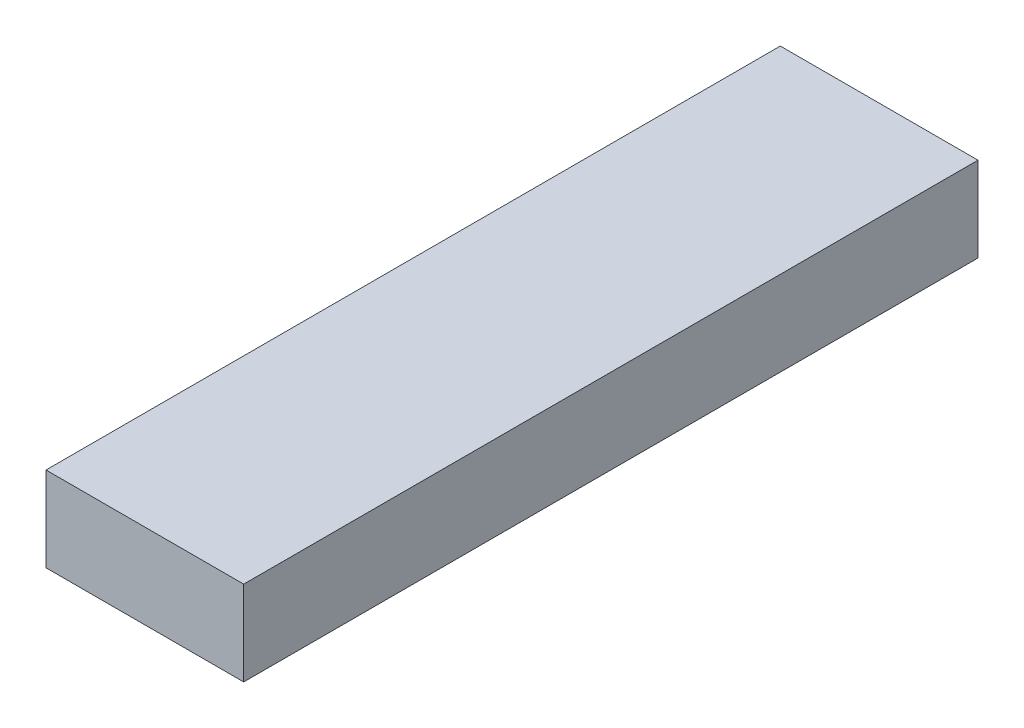
ISO-10303-21;
HEADER;
FILE_DESCRIPTION(('STEP AP214'),'2;1');
FILE_NAME('part.step','',(''),(''),'','','');
FILE_SCHEMA(('AUTOMOTIVE_DESIGN { 1 0 10303 214 1 1 1 1 }'));
ENDSEC;
DATA;
#1=APPLICATION_CONTEXT('core data for automotive mechanical design processes');
#2=APPLICATION_PROTOCOL_DEFINITION('international standard','automotive_design',2000,#1);
#3=PRODUCT_CONTEXT('',#1,'mechanical');
#4=PRODUCT('Part','Part','',(#3));
#5=PRODUCT_RELATED_PRODUCT_CATEGORY('part','',(#4));
#6=PRODUCT_DEFINITION_FORMATION('','',#4);
#7=PRODUCT_DEFINITION_CONTEXT('part definition',#1,'design');
#8=PRODUCT_DEFINITION('design','',#6,#7);
#9=PRODUCT_DEFINITION_SHAPE('','',#8);
#10=(LENGTH_UNIT() NAMED_UNIT(*) SI_UNIT(.MILLI.,.METRE.));
#11=(NAMED_UNIT(*) PLANE_ANGLE_UNIT() SI_UNIT($,.RADIAN.));
#12=(NAMED_UNIT(*) SI_UNIT($,.STERADIAN.) SOLID_ANGLE_UNIT());
#13=UNCERTAINTY_MEASURE_WITH_UNIT(LENGTH_MEASURE(1.E-05),#10,'distance_accuracy_value','');
#14=(GEOMETRIC_REPRESENTATION_CONTEXT(3) GLOBAL_UNCERTAINTY_ASSIGNED_CONTEXT((#13)) GLOBAL_UNIT_ASSIGNED_CONTEXT((#10,
#11,#12)) REPRESENTATION_CONTEXT('',''));
#15=CARTESIAN_POINT('',(0.,0.,0.));
#16=DIRECTION('',(0.,0.,1.));
#17=DIRECTION('',(1.,0.,0.));
#18=AXIS2_PLACEMENT_3D('',#15,#16,#17);
#19=CARTESIAN_POINT('',(80.1838268157808,99.2259583588317,330.2));
#20=DIRECTION('',(1.,0.,0.));
#21=DIRECTION('',(0.,1.,0.));
#22=AXIS2_PLACEMENT_3D('',#19,#20,#21);
#23=PLANE('',#22);
#24=DIRECTION('',(0.,-1.,0.));
#25=VECTOR('',#24,1.);
#26=CARTESIAN_POINT('',(80.1838268157808,99.2259583588317,0.));
#27=LINE('',#26,#25);
#28=CARTESIAN_POINT('',(80.1838268157808,99.2259583588317,0.));
#29=VERTEX_POINT('',#28);
#30=CARTESIAN_POINT('',(80.1838268157808,61.1259583588317,0.));
#31=VERTEX_POINT('',#30);
#32=EDGE_CURVE('E95',#29,#31,#27,.T.);
#33=ORIENTED_EDGE('',*,*,#32,.T.);
#34=DIRECTION('',(0.,0.,-1.));
#35=VECTOR('',#34,1.);
#36=CARTESIAN_POINT('',(80.1838268157808,61.1259583588317,330.2));
#37=LINE('',#36,#35);
#38=CARTESIAN_POINT('',(80.1838268157808,61.1259583588317,330.2));
#39=VERTEX_POINT('',#38);
#40=EDGE_CURVE('E11',#39,#31,#37,.T.);
#41=ORIENTED_EDGE('',*,*,#40,.F.);
#42=DIRECTION('',(0.,-1.,0.));
#43=VECTOR('',#42,1.);
#44=CARTESIAN_POINT('',(80.1838268157808,99.2259583588317,330.2));
#45=LINE('',#44,#43);
#46=CARTESIAN_POINT('',(80.1838268157808,99.2259583588317,330.2));
#47=VERTEX_POINT('',#46);
#48=EDGE_CURVE('E83',#47,#39,#45,.T.);
#49=ORIENTED_EDGE('',*,*,#48,.F.);
#50=DIRECTION('',(0.,0.,-1.));
#51=VECTOR('',#50,1.);
#52=CARTESIAN_POINT('',(80.1838268157808,99.2259583588317,330.2));
#53=LINE('',#52,#51);
#54=EDGE_CURVE('E91',#47,#29,#53,.T.);
#55=ORIENTED_EDGE('',*,*,#54,.T.);
#56=EDGE_LOOP('',(#33,#41,#49,#55));
#57=FACE_BOUND('',#56,.T.);
#58=ADVANCED_FACE('F32',(#57),#23,.F.);
#59=CARTESIAN_POINT('',(80.1838268157808,61.1259583588317,330.2));
#60=DIRECTION('',(0.,1.,0.));
#61=DIRECTION('',(0.,0.,1.));
#62=AXIS2_PLACEMENT_3D('',#59,#60,#61);
#63=PLANE('',#62);
#64=DIRECTION('',(1.,0.,0.));
#65=VECTOR('',#64,1.);
#66=CARTESIAN_POINT('',(80.1838268157808,61.1259583588317,0.));
#67=LINE('',#66,#65);
#68=CARTESIAN_POINT('',(169.083826815781,61.1259583588317,0.));
#69=VERTEX_POINT('',#68);
#70=EDGE_CURVE('E87',#31,#69,#67,.T.);
#71=ORIENTED_EDGE('',*,*,#70,.T.);
#72=DIRECTION('',(0.,0.,-1.));
#73=VECTOR('',#72,1.);
#74=CARTESIAN_POINT('',(169.083826815781,61.1259583588317,330.2));
#75=LINE('',#74,#73);
#76=CARTESIAN_POINT('',(169.083826815781,61.1259583588317,330.2));
#77=VERTEX_POINT('',#76);
#78=EDGE_CURVE('E40',#77,#69,#75,.T.);
#79=ORIENTED_EDGE('',*,*,#78,.F.);
#80=DIRECTION('',(1.,0.,0.));
#81=VECTOR('',#80,1.);
#82=CARTESIAN_POINT('',(80.1838268157808,61.1259583588317,330.2));
#83=LINE('',#82,#81);
#84=EDGE_CURVE('E78',#39,#77,#83,.T.);
#85=ORIENTED_EDGE('',*,*,#84,.F.);
#86=ORIENTED_EDGE('',*,*,#40,.T.);
#87=EDGE_LOOP('',(#71,#79,#85,#86));
#88=FACE_BOUND('',#87,.T.);
#89=ADVANCED_FACE('F86',(#88),#63,.F.);
#90=CARTESIAN_POINT('',(169.083826815781,99.2259583588317,330.2));
#91=DIRECTION('',(-1.,0.,0.));
#92=DIRECTION('',(0.,0.,1.));
#93=AXIS2_PLACEMENT_3D('',#90,#91,#92);
#94=PLANE('',#93);
#95=DIRECTION('',(0.,1.,0.));
#96=VECTOR('',#95,1.);
#97=CARTESIAN_POINT('',(169.083826815781,99.2259583588317,0.));
#98=LINE('',#97,#96);
#99=CARTESIAN_POINT('',(169.083826815781,99.2259583588317,0.));
#100=VERTEX_POINT('',#99);
#101=EDGE_CURVE('E65',#69,#100,#98,.T.);
#102=ORIENTED_EDGE('',*,*,#101,.T.);
#103=DIRECTION('',(0.,0.,-1.));
#104=VECTOR('',#103,1.);
#105=CARTESIAN_POINT('',(169.083826815781,99.2259583588317,330.2));
#106=LINE('',#105,#104);
#107=CARTESIAN_POINT('',(169.083826815781,99.2259583588317,330.2));
#108=VERTEX_POINT('',#107);
#109=EDGE_CURVE('E88',#108,#100,#106,.T.);
#110=ORIENTED_EDGE('',*,*,#109,.F.);
#111=DIRECTION('',(0.,1.,0.));
#112=VECTOR('',#111,1.);
#113=CARTESIAN_POINT('',(169.083826815781,99.2259583588317,330.2));
#114=LINE('',#113,#112);
#115=EDGE_CURVE('E81',#77,#108,#114,.T.);
#116=ORIENTED_EDGE('',*,*,#115,.F.);
#117=ORIENTED_EDGE('',*,*,#78,.T.);
#118=EDGE_LOOP('',(#102,#110,#116,#117));
#119=FACE_BOUND('',#118,.T.);
#120=ADVANCED_FACE('F89',(#119),#94,.F.);
#121=CARTESIAN_POINT('',(80.1838268157808,99.2259583588317,330.2));
#122=DIRECTION('',(0.,-1.,0.));
#123=DIRECTION('',(0.,0.,-1.));
#124=AXIS2_PLACEMENT_3D('',#121,#122,#123);
#125=PLANE('',#124);
#126=DIRECTION('',(-1.,0.,0.));
#127=VECTOR('',#126,1.);
#128=CARTESIAN_POINT('',(80.1838268157808,99.2259583588317,0.));
#129=LINE('',#128,#127);
#130=EDGE_CURVE('E71',#100,#29,#129,.T.);
#131=ORIENTED_EDGE('',*,*,#130,.T.);
#132=ORIENTED_EDGE('',*,*,#54,.F.);
#133=DIRECTION('',(-1.,0.,0.));
#134=VECTOR('',#133,1.);
#135=CARTESIAN_POINT('',(80.1838268157808,99.2259583588317,330.2));
#136=LINE('',#135,#134);
#137=EDGE_CURVE('E48',#108,#47,#136,.T.);
#138=ORIENTED_EDGE('',*,*,#137,.F.);
#139=ORIENTED_EDGE('',*,*,#109,.T.);
#140=EDGE_LOOP('',(#131,#132,#138,#139));
#141=FACE_BOUND('',#140,.T.);
#142=ADVANCED_FACE('F102',(#141),#125,.F.);
#143=CARTESIAN_POINT('',(0.,0.,330.2));
#144=DIRECTION('',(0.,0.,1.));
#145=DIRECTION('',(1.,0.,0.));
#146=AXIS2_PLACEMENT_3D('',#143,#144,#145);
#147=PLANE('',#146);
#148=ORIENTED_EDGE('',*,*,#48,.T.);
#149=ORIENTED_EDGE('',*,*,#84,.T.);
#150=ORIENTED_EDGE('',*,*,#115,.T.);
#151=ORIENTED_EDGE('',*,*,#137,.T.);
#152=EDGE_LOOP('',(#148,#149,#150,#151));
#153=FACE_BOUND('',#152,.T.);
#154=ADVANCED_FACE('F79',(#153),#147,.T.);
#155=CARTESIAN_POINT('',(0.,0.,0.));
#156=DIRECTION('',(0.,0.,1.));
#157=DIRECTION('',(1.,0.,0.));
#158=AXIS2_PLACEMENT_3D('',#155,#156,#157);
#159=PLANE('',#158);
#160=ORIENTED_EDGE('',*,*,#32,.F.);
#161=ORIENTED_EDGE('',*,*,#130,.F.);
#162=ORIENTED_EDGE('',*,*,#101,.F.);
#163=ORIENTED_EDGE('',*,*,#70,.F.);
#164=EDGE_LOOP('',(#160,#161,#162,#163));
#165=FACE_BOUND('',#164,.T.);
#166=ADVANCED_FACE('F105',(#165),#159,.F.);
#167=CLOSED_SHELL('',(#58,#89,#120,#142,#154,#166));
#168=MANIFOLD_SOLID_BREP('B2',#167);
#169=ADVANCED_BREP_SHAPE_REPRESENTATION('',(#18,#168),#14);
#170=SHAPE_DEFINITION_REPRESENTATION(#9,#169);
ENDSEC;
END-ISO-10303-21;
